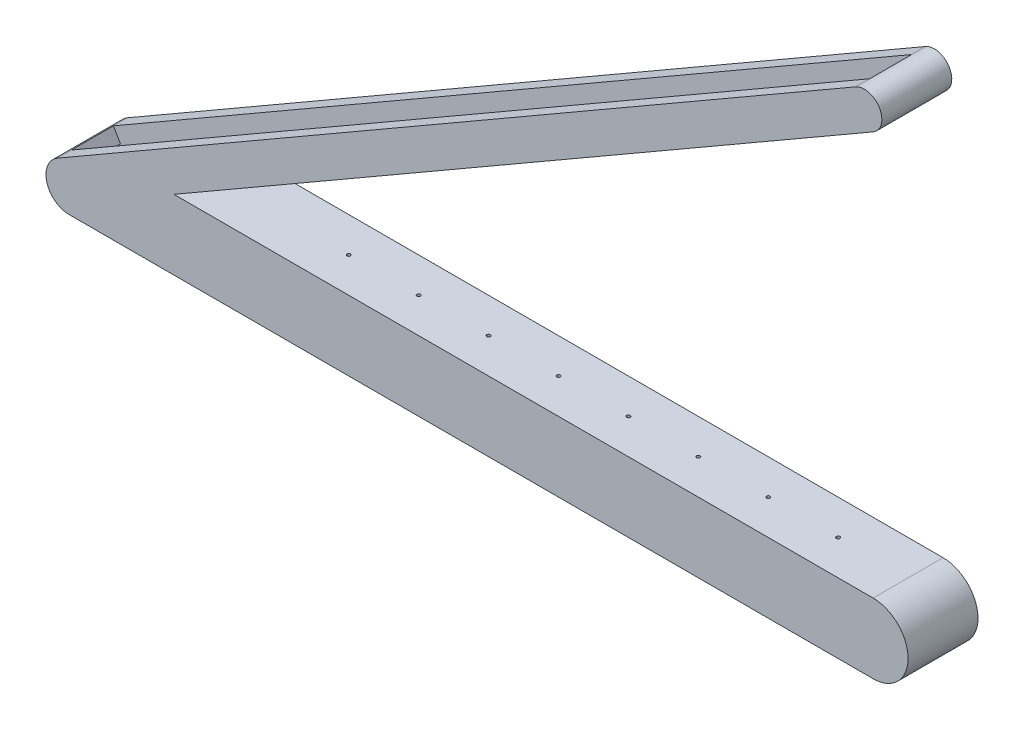
ISO-10303-21;
HEADER;
FILE_DESCRIPTION(('STEP AP214'),'2;1');
FILE_NAME('part.step','',(''),(''),'','','');
FILE_SCHEMA(('AUTOMOTIVE_DESIGN { 1 0 10303 214 1 1 1 1 }'));
ENDSEC;
DATA;
#1=APPLICATION_CONTEXT('core data for automotive mechanical design processes');
#2=APPLICATION_PROTOCOL_DEFINITION('international standard','automotive_design',2000,#1);
#3=PRODUCT_CONTEXT('',#1,'mechanical');
#4=PRODUCT('Part','Part','',(#3));
#5=PRODUCT_RELATED_PRODUCT_CATEGORY('part','',(#4));
#6=PRODUCT_DEFINITION_FORMATION('','',#4);
#7=PRODUCT_DEFINITION_CONTEXT('part definition',#1,'design');
#8=PRODUCT_DEFINITION('design','',#6,#7);
#9=PRODUCT_DEFINITION_SHAPE('','',#8);
#10=(LENGTH_UNIT() NAMED_UNIT(*) SI_UNIT(.MILLI.,.METRE.));
#11=(NAMED_UNIT(*) PLANE_ANGLE_UNIT() SI_UNIT($,.RADIAN.));
#12=(NAMED_UNIT(*) SI_UNIT($,.STERADIAN.) SOLID_ANGLE_UNIT());
#13=UNCERTAINTY_MEASURE_WITH_UNIT(LENGTH_MEASURE(1.E-05),#10,'distance_accuracy_value','');
#14=(GEOMETRIC_REPRESENTATION_CONTEXT(3) GLOBAL_UNCERTAINTY_ASSIGNED_CONTEXT((#13)) GLOBAL_UNIT_ASSIGNED_CONTEXT((#10,
#11,#12)) REPRESENTATION_CONTEXT('',''));
#15=CARTESIAN_POINT('',(0.,0.,0.));
#16=DIRECTION('',(0.,0.,1.));
#17=DIRECTION('',(1.,0.,0.));
#18=AXIS2_PLACEMENT_3D('',#15,#16,#17);
#19=CARTESIAN_POINT('',(-166.50635094611,-38.3974596215563,100.));
#20=DIRECTION('',(0.500000000000001,-0.866025403784438,0.));
#21=DIRECTION('',(0.866025403784438,0.500000000000001,0.));
#22=AXIS2_PLACEMENT_3D('',#19,#20,#21);
#23=PLANE('',#22);
#24=DIRECTION('',(-0.866025403784438,-0.500000000000001,0.));
#25=VECTOR('',#24,1.);
#26=CARTESIAN_POINT('',(-166.50635094611,-38.3974596215563,20.));
#27=LINE('',#26,#25);
#28=CARTESIAN_POINT('',(975.,620.651539378849,20.));
#29=VERTEX_POINT('',#28);
#30=CARTESIAN_POINT('',(-166.50635094611,-38.3974596215563,20.));
#31=VERTEX_POINT('',#30);
#32=EDGE_CURVE('E180',#29,#31,#27,.T.);
#33=ORIENTED_EDGE('',*,*,#32,.F.);
#34=DIRECTION('',(0.,0.,-1.));
#35=VECTOR('',#34,1.);
#36=CARTESIAN_POINT('',(975.,620.651539378849,100.));
#37=LINE('',#36,#35);
#38=CARTESIAN_POINT('',(975.,620.651539378849,0.));
#39=VERTEX_POINT('',#38);
#40=EDGE_CURVE('E364',#29,#39,#37,.T.);
#41=ORIENTED_EDGE('',*,*,#40,.T.);
#42=DIRECTION('',(-0.866025403784438,-0.500000000000001,0.));
#43=VECTOR('',#42,1.);
#44=CARTESIAN_POINT('',(-166.50635094611,-38.3974596215563,0.));
#45=LINE('',#44,#43);
#46=CARTESIAN_POINT('',(-166.50635094611,-38.3974596215563,0.));
#47=VERTEX_POINT('',#46);
#48=EDGE_CURVE('E325',#39,#47,#45,.T.);
#49=ORIENTED_EDGE('',*,*,#48,.T.);
#50=DIRECTION('',(0.,0.,-1.));
#51=VECTOR('',#50,1.);
#52=CARTESIAN_POINT('',(-166.50635094611,-38.3974596215563,100.));
#53=LINE('',#52,#51);
#54=EDGE_CURVE('E359',#31,#47,#53,.T.);
#55=ORIENTED_EDGE('',*,*,#54,.F.);
#56=EDGE_LOOP('',(#33,#41,#49,#55));
#57=FACE_BOUND('',#56,.T.);
#58=ADVANCED_FACE('F41',(#57),#23,.F.);
#59=CARTESIAN_POINT('',(1000.,-99.9999999999999,100.));
#60=DIRECTION('',(0.,1.,0.));
#61=DIRECTION('',(-1.,0.,0.));
#62=AXIS2_PLACEMENT_3D('',#59,#60,#61);
#63=PLANE('',#62);
#64=DIRECTION('',(1.,0.,0.));
#65=VECTOR('',#64,1.);
#66=CARTESIAN_POINT('',(1000.,-99.9999999999999,20.));
#67=LINE('',#66,#65);
#68=CARTESIAN_POINT('',(-150.,-100.,20.));
#69=VERTEX_POINT('',#68);
#70=CARTESIAN_POINT('',(1000.,-99.9999999999999,20.));
#71=VERTEX_POINT('',#70);
#72=EDGE_CURVE('E233',#69,#71,#67,.T.);
#73=ORIENTED_EDGE('',*,*,#72,.F.);
#74=DIRECTION('',(0.,0.,-1.));
#75=VECTOR('',#74,1.);
#76=CARTESIAN_POINT('',(-150.,-100.,100.));
#77=LINE('',#76,#75);
#78=CARTESIAN_POINT('',(-150.,-100.,0.));
#79=VERTEX_POINT('',#78);
#80=EDGE_CURVE('E354',#69,#79,#77,.T.);
#81=ORIENTED_EDGE('',*,*,#80,.T.);
#82=DIRECTION('',(1.,0.,0.));
#83=VECTOR('',#82,1.);
#84=CARTESIAN_POINT('',(1000.,-99.9999999999999,0.));
#85=LINE('',#84,#83);
#86=CARTESIAN_POINT('',(1000.,-99.9999999999999,0.));
#87=VERTEX_POINT('',#86);
#88=EDGE_CURVE('E333',#79,#87,#85,.T.);
#89=ORIENTED_EDGE('',*,*,#88,.T.);
#90=DIRECTION('',(0.,0.,-1.));
#91=VECTOR('',#90,1.);
#92=CARTESIAN_POINT('',(1000.,-99.9999999999999,100.));
#93=LINE('',#92,#91);
#94=EDGE_CURVE('E349',#71,#87,#93,.T.);
#95=ORIENTED_EDGE('',*,*,#94,.F.);
#96=EDGE_LOOP('',(#73,#81,#89,#95));
#97=FACE_BOUND('',#96,.T.);
#98=ADVANCED_FACE('F470',(#97),#63,.F.);
#99=CARTESIAN_POINT('',(0.,0.,100.));
#100=DIRECTION('',(-0.500000000000001,0.866025403784438,0.));
#101=DIRECTION('',(-0.866025403784438,-0.500000000000001,0.));
#102=AXIS2_PLACEMENT_3D('',#99,#100,#101);
#103=PLANE('',#102);
#104=CARTESIAN_POINT('',(200.,115.470053837926,50.));
#105=DIRECTION('',(-0.500000000000001,0.866025403784438,0.));
#106=DIRECTION('',(-0.866025403784438,-0.500000000000001,0.));
#107=AXIS2_PLACEMENT_3D('',#104,#105,#106);
#108=ELLIPSE('',#107,2.88675134594813,2.5);
#109=CARTESIAN_POINT('',(197.5,114.026678164952,50.));
#110=VERTEX_POINT('',#109);
#111=EDGE_CURVE('E199',#110,#110,#108,.F.);
#112=ORIENTED_EDGE('',*,*,#111,.F.);
#113=EDGE_LOOP('',(#112));
#114=FACE_BOUND('',#113,.T.);
#115=CARTESIAN_POINT('',(300.,173.205080756888,50.));
#116=DIRECTION('',(-0.500000000000001,0.866025403784438,0.));
#117=DIRECTION('',(-0.866025403784438,-0.500000000000001,0.));
#118=AXIS2_PLACEMENT_3D('',#115,#116,#117);
#119=ELLIPSE('',#118,2.8867513459481,2.49999999999997);
#120=CARTESIAN_POINT('',(297.5,171.761705083914,50.));
#121=VERTEX_POINT('',#120);
#122=EDGE_CURVE('E427',#121,#121,#119,.F.);
#123=ORIENTED_EDGE('',*,*,#122,.F.);
#124=EDGE_LOOP('',(#123));
#125=FACE_BOUND('',#124,.T.);
#126=CARTESIAN_POINT('',(400.,230.940107675851,50.));
#127=DIRECTION('',(-0.500000000000001,0.866025403784438,0.));
#128=DIRECTION('',(-0.866025403784438,-0.500000000000001,0.));
#129=AXIS2_PLACEMENT_3D('',#126,#127,#128);
#130=ELLIPSE('',#129,2.8867513459481,2.49999999999997);
#131=CARTESIAN_POINT('',(397.5,229.496732002877,50.));
#132=VERTEX_POINT('',#131);
#133=EDGE_CURVE('E406',#132,#132,#130,.F.);
#134=ORIENTED_EDGE('',*,*,#133,.F.);
#135=EDGE_LOOP('',(#134));
#136=FACE_BOUND('',#135,.T.);
#137=CARTESIAN_POINT('',(500.,288.675134594814,50.));
#138=DIRECTION('',(-0.500000000000001,0.866025403784438,0.));
#139=DIRECTION('',(-0.866025403784438,-0.500000000000001,0.));
#140=AXIS2_PLACEMENT_3D('',#137,#138,#139);
#141=ELLIPSE('',#140,2.88675134594816,2.50000000000002);
#142=CARTESIAN_POINT('',(497.5,287.23175892184,50.));
#143=VERTEX_POINT('',#142);
#144=EDGE_CURVE('E401',#143,#143,#141,.F.);
#145=ORIENTED_EDGE('',*,*,#144,.F.);
#146=EDGE_LOOP('',(#145));
#147=FACE_BOUND('',#146,.T.);
#148=CARTESIAN_POINT('',(600.,346.410161513777,50.));
#149=DIRECTION('',(-0.500000000000001,0.866025403784438,0.));
#150=DIRECTION('',(-0.866025403784438,-0.500000000000001,0.));
#151=AXIS2_PLACEMENT_3D('',#148,#149,#150);
#152=ELLIPSE('',#151,2.88675134594816,2.50000000000002);
#153=CARTESIAN_POINT('',(597.5,344.966785840803,50.));
#154=VERTEX_POINT('',#153);
#155=EDGE_CURVE('E396',#154,#154,#152,.F.);
#156=ORIENTED_EDGE('',*,*,#155,.F.);
#157=EDGE_LOOP('',(#156));
#158=FACE_BOUND('',#157,.T.);
#159=CARTESIAN_POINT('',(700.,404.14518843274,50.));
#160=DIRECTION('',(-0.500000000000001,0.866025403784438,0.));
#161=DIRECTION('',(-0.866025403784438,-0.500000000000001,0.));
#162=AXIS2_PLACEMENT_3D('',#159,#160,#161);
#163=ELLIPSE('',#162,2.88675134594816,2.50000000000002);
#164=CARTESIAN_POINT('',(697.5,402.701812759765,50.));
#165=VERTEX_POINT('',#164);
#166=EDGE_CURVE('E390',#165,#165,#163,.F.);
#167=ORIENTED_EDGE('',*,*,#166,.F.);
#168=EDGE_LOOP('',(#167));
#169=FACE_BOUND('',#168,.T.);
#170=CARTESIAN_POINT('',(800.,461.880215351702,50.));
#171=DIRECTION('',(-0.500000000000001,0.866025403784438,0.));
#172=DIRECTION('',(-0.866025403784438,-0.500000000000001,0.));
#173=AXIS2_PLACEMENT_3D('',#170,#171,#172);
#174=ELLIPSE('',#173,2.88675134594816,2.50000000000002);
#175=CARTESIAN_POINT('',(797.5,460.436839678728,50.));
#176=VERTEX_POINT('',#175);
#177=EDGE_CURVE('E384',#176,#176,#174,.F.);
#178=ORIENTED_EDGE('',*,*,#177,.F.);
#179=EDGE_LOOP('',(#178));
#180=FACE_BOUND('',#179,.T.);
#181=CARTESIAN_POINT('',(900.,519.615242270665,50.));
#182=DIRECTION('',(-0.500000000000001,0.866025403784438,0.));
#183=DIRECTION('',(-0.866025403784438,-0.500000000000001,0.));
#184=AXIS2_PLACEMENT_3D('',#181,#182,#183);
#185=ELLIPSE('',#184,2.88675134594816,2.50000000000002);
#186=CARTESIAN_POINT('',(897.5,518.171866597691,50.));
#187=VERTEX_POINT('',#186);
#188=EDGE_CURVE('E378',#187,#187,#185,.F.);
#189=ORIENTED_EDGE('',*,*,#188,.F.);
#190=EDGE_LOOP('',(#189));
#191=FACE_BOUND('',#190,.T.);
#192=DIRECTION('',(0.866025403784438,0.500000000000001,0.));
#193=VECTOR('',#192,1.);
#194=CARTESIAN_POINT('',(0.,0.,0.));
#195=LINE('',#194,#193);
#196=CARTESIAN_POINT('',(0.,0.,0.));
#197=VERTEX_POINT('',#196);
#198=CARTESIAN_POINT('',(1000.,577.350269189628,0.));
#199=VERTEX_POINT('',#198);
#200=EDGE_CURVE('E290',#197,#199,#195,.T.);
#201=ORIENTED_EDGE('',*,*,#200,.T.);
#202=DIRECTION('',(0.,0.,-1.));
#203=VECTOR('',#202,1.);
#204=CARTESIAN_POINT('',(1000.,577.350269189628,100.));
#205=LINE('',#204,#203);
#206=CARTESIAN_POINT('',(1000.,577.350269189628,100.));
#207=VERTEX_POINT('',#206);
#208=EDGE_CURVE('E11',#207,#199,#205,.T.);
#209=ORIENTED_EDGE('',*,*,#208,.F.);
#210=DIRECTION('',(0.866025403784438,0.500000000000001,0.));
#211=VECTOR('',#210,1.);
#212=CARTESIAN_POINT('',(0.,0.,100.));
#213=LINE('',#212,#211);
#214=CARTESIAN_POINT('',(0.,0.,100.));
#215=VERTEX_POINT('',#214);
#216=EDGE_CURVE('E294',#215,#207,#213,.T.);
#217=ORIENTED_EDGE('',*,*,#216,.F.);
#218=DIRECTION('',(0.,0.,-1.));
#219=VECTOR('',#218,1.);
#220=CARTESIAN_POINT('',(0.,0.,100.));
#221=LINE('',#220,#219);
#222=EDGE_CURVE('E317',#215,#197,#221,.T.);
#223=ORIENTED_EDGE('',*,*,#222,.T.);
#224=EDGE_LOOP('',(#201,#209,#217,#223));
#225=FACE_BOUND('',#224,.T.);
#226=ADVANCED_FACE('F43',(#114,#125,#136,#147,#158,#169,#180,#191,#225),#103,.F.);
#227=CARTESIAN_POINT('',(987.5,599.000904284239,100.));
#228=DIRECTION('',(0.,0.,-1.));
#229=DIRECTION('',(-1.,0.,0.));
#230=AXIS2_PLACEMENT_3D('',#227,#228,#229);
#231=CYLINDRICAL_SURFACE('',#230,24.9999999999999);
#232=CARTESIAN_POINT('',(987.5,599.000904284239,0.));
#233=DIRECTION('',(0.,0.,1.));
#234=DIRECTION('',(1.,0.,0.));
#235=AXIS2_PLACEMENT_3D('',#232,#233,#234);
#236=CIRCLE('',#235,24.9999999999999);
#237=EDGE_CURVE('E321',#199,#39,#236,.T.);
#238=ORIENTED_EDGE('',*,*,#237,.T.);
#239=ORIENTED_EDGE('',*,*,#40,.F.);
#240=DIRECTION('',(0.,0.,-1.));
#241=VECTOR('',#240,1.);
#242=CARTESIAN_POINT('',(975.,620.651539378849,100.));
#243=LINE('',#242,#241);
#244=CARTESIAN_POINT('',(975.,620.651539378849,80.));
#245=VERTEX_POINT('',#244);
#246=EDGE_CURVE('E192',#245,#29,#243,.T.);
#247=ORIENTED_EDGE('',*,*,#246,.F.);
#248=CARTESIAN_POINT('',(975.,620.651539378849,100.));
#249=VERTEX_POINT('',#248);
#250=EDGE_CURVE('E51',#249,#245,#37,.T.);
#251=ORIENTED_EDGE('',*,*,#250,.F.);
#252=CARTESIAN_POINT('',(987.5,599.000904284239,100.));
#253=DIRECTION('',(0.,0.,1.));
#254=DIRECTION('',(1.,0.,0.));
#255=AXIS2_PLACEMENT_3D('',#252,#253,#254);
#256=CIRCLE('',#255,24.9999999999999);
#257=EDGE_CURVE('E298',#207,#249,#256,.T.);
#258=ORIENTED_EDGE('',*,*,#257,.F.);
#259=ORIENTED_EDGE('',*,*,#208,.T.);
#260=EDGE_LOOP('',(#238,#239,#247,#251,#258,#259));
#261=FACE_BOUND('',#260,.T.);
#262=ADVANCED_FACE('F456',(#261),#231,.T.);
#263=ORIENTED_EDGE('',*,*,#250,.T.);
#264=DIRECTION('',(-0.866025403784438,-0.500000000000001,0.));
#265=VECTOR('',#264,1.);
#266=CARTESIAN_POINT('',(-166.50635094611,-38.3974596215563,80.));
#267=LINE('',#266,#265);
#268=CARTESIAN_POINT('',(-166.50635094611,-38.3974596215563,80.));
#269=VERTEX_POINT('',#268);
#270=EDGE_CURVE('E218',#245,#269,#267,.T.);
#271=ORIENTED_EDGE('',*,*,#270,.T.);
#272=CARTESIAN_POINT('',(-166.50635094611,-38.3974596215563,100.));
#273=VERTEX_POINT('',#272);
#274=EDGE_CURVE('E360',#273,#269,#53,.T.);
#275=ORIENTED_EDGE('',*,*,#274,.F.);
#276=DIRECTION('',(-0.866025403784438,-0.500000000000001,0.));
#277=VECTOR('',#276,1.);
#278=CARTESIAN_POINT('',(-166.50635094611,-38.3974596215563,100.));
#279=LINE('',#278,#277);
#280=EDGE_CURVE('E302',#249,#273,#279,.T.);
#281=ORIENTED_EDGE('',*,*,#280,.F.);
#282=EDGE_LOOP('',(#263,#271,#275,#281));
#283=FACE_BOUND('',#282,.T.);
#284=ADVANCED_FACE('F507',(#283),#23,.F.);
#285=CARTESIAN_POINT('',(-150.,-66.9872981077808,100.));
#286=DIRECTION('',(0.,0.,-1.));
#287=DIRECTION('',(-1.,0.,0.));
#288=AXIS2_PLACEMENT_3D('',#285,#286,#287);
#289=CYLINDRICAL_SURFACE('',#288,33.0127018922193);
#290=CARTESIAN_POINT('',(-150.,-66.9872981077808,0.));
#291=DIRECTION('',(0.,0.,1.));
#292=DIRECTION('',(1.,0.,0.));
#293=AXIS2_PLACEMENT_3D('',#290,#291,#292);
#294=CIRCLE('',#293,33.0127018922193);
#295=EDGE_CURVE('E329',#47,#79,#294,.T.);
#296=ORIENTED_EDGE('',*,*,#295,.T.);
#297=ORIENTED_EDGE('',*,*,#80,.F.);
#298=DIRECTION('',(0.,0.,-1.));
#299=VECTOR('',#298,1.);
#300=CARTESIAN_POINT('',(-150.,-100.,100.));
#301=LINE('',#300,#299);
#302=CARTESIAN_POINT('',(-150.,-100.,80.));
#303=VERTEX_POINT('',#302);
#304=EDGE_CURVE('E441',#303,#69,#301,.T.);
#305=ORIENTED_EDGE('',*,*,#304,.F.);
#306=CARTESIAN_POINT('',(-150.,-100.,100.));
#307=VERTEX_POINT('',#306);
#308=EDGE_CURVE('E355',#307,#303,#77,.T.);
#309=ORIENTED_EDGE('',*,*,#308,.F.);
#310=CARTESIAN_POINT('',(-150.,-66.9872981077808,100.));
#311=DIRECTION('',(0.,0.,1.));
#312=DIRECTION('',(1.,0.,0.));
#313=AXIS2_PLACEMENT_3D('',#310,#311,#312);
#314=CIRCLE('',#313,33.0127018922193);
#315=EDGE_CURVE('E305',#273,#307,#314,.T.);
#316=ORIENTED_EDGE('',*,*,#315,.F.);
#317=ORIENTED_EDGE('',*,*,#274,.T.);
#318=DIRECTION('',(0.,0.,-1.));
#319=VECTOR('',#318,1.);
#320=CARTESIAN_POINT('',(-166.50635094611,-38.3974596215563,100.));
#321=LINE('',#320,#319);
#322=EDGE_CURVE('E443',#269,#31,#321,.T.);
#323=ORIENTED_EDGE('',*,*,#322,.T.);
#324=ORIENTED_EDGE('',*,*,#54,.T.);
#325=EDGE_LOOP('',(#296,#297,#305,#309,#316,#317,#323,#324));
#326=FACE_BOUND('',#325,.T.);
#327=ADVANCED_FACE('F497',(#326),#289,.T.);
#328=ORIENTED_EDGE('',*,*,#308,.T.);
#329=DIRECTION('',(1.,0.,0.));
#330=VECTOR('',#329,1.);
#331=CARTESIAN_POINT('',(1000.,-99.9999999999999,80.));
#332=LINE('',#331,#330);
#333=CARTESIAN_POINT('',(1000.,-99.9999999999999,80.));
#334=VERTEX_POINT('',#333);
#335=EDGE_CURVE('E223',#303,#334,#332,.T.);
#336=ORIENTED_EDGE('',*,*,#335,.T.);
#337=CARTESIAN_POINT('',(1000.,-99.9999999999999,100.));
#338=VERTEX_POINT('',#337);
#339=EDGE_CURVE('E350',#338,#334,#93,.T.);
#340=ORIENTED_EDGE('',*,*,#339,.F.);
#341=DIRECTION('',(1.,0.,0.));
#342=VECTOR('',#341,1.);
#343=CARTESIAN_POINT('',(1000.,-99.9999999999999,100.));
#344=LINE('',#343,#342);
#345=EDGE_CURVE('E308',#307,#338,#344,.T.);
#346=ORIENTED_EDGE('',*,*,#345,.F.);
#347=EDGE_LOOP('',(#328,#336,#340,#346));
#348=FACE_BOUND('',#347,.T.);
#349=ADVANCED_FACE('F490',(#348),#63,.F.);
#350=CARTESIAN_POINT('',(1000.,-50.,100.));
#351=DIRECTION('',(0.,0.,-1.));
#352=DIRECTION('',(-1.,0.,0.));
#353=AXIS2_PLACEMENT_3D('',#350,#351,#352);
#354=CYLINDRICAL_SURFACE('',#353,50.);
#355=CARTESIAN_POINT('',(1000.,-50.,0.));
#356=DIRECTION('',(0.,0.,1.));
#357=DIRECTION('',(-1.,0.,0.));
#358=AXIS2_PLACEMENT_3D('',#355,#356,#357);
#359=CIRCLE('',#358,50.);
#360=CARTESIAN_POINT('',(1000.,0.,0.));
#361=VERTEX_POINT('',#360);
#362=EDGE_CURVE('E337',#87,#361,#359,.T.);
#363=ORIENTED_EDGE('',*,*,#362,.T.);
#364=DIRECTION('',(0.,0.,-1.));
#365=VECTOR('',#364,1.);
#366=CARTESIAN_POINT('',(1000.,0.,100.));
#367=LINE('',#366,#365);
#368=CARTESIAN_POINT('',(1000.,0.,100.));
#369=VERTEX_POINT('',#368);
#370=EDGE_CURVE('E345',#369,#361,#367,.T.);
#371=ORIENTED_EDGE('',*,*,#370,.F.);
#372=CARTESIAN_POINT('',(1000.,-50.,100.));
#373=DIRECTION('',(0.,0.,1.));
#374=DIRECTION('',(-1.,0.,0.));
#375=AXIS2_PLACEMENT_3D('',#372,#373,#374);
#376=CIRCLE('',#375,50.);
#377=EDGE_CURVE('E311',#338,#369,#376,.T.);
#378=ORIENTED_EDGE('',*,*,#377,.F.);
#379=ORIENTED_EDGE('',*,*,#339,.T.);
#380=DIRECTION('',(0.,0.,-1.));
#381=VECTOR('',#380,1.);
#382=CARTESIAN_POINT('',(1000.,-99.9999999999999,100.));
#383=LINE('',#382,#381);
#384=EDGE_CURVE('E242',#334,#71,#383,.T.);
#385=ORIENTED_EDGE('',*,*,#384,.T.);
#386=ORIENTED_EDGE('',*,*,#94,.T.);
#387=EDGE_LOOP('',(#363,#371,#378,#379,#385,#386));
#388=FACE_BOUND('',#387,.T.);
#389=ADVANCED_FACE('F464',(#388),#354,.T.);
#390=CARTESIAN_POINT('',(0.,0.,100.));
#391=DIRECTION('',(0.,-1.,0.));
#392=DIRECTION('',(0.,0.,-1.));
#393=AXIS2_PLACEMENT_3D('',#390,#391,#392);
#394=PLANE('',#393);
#395=CARTESIAN_POINT('',(200.,0.,50.));
#396=DIRECTION('',(0.,-1.,0.));
#397=DIRECTION('',(0.,0.,-1.));
#398=AXIS2_PLACEMENT_3D('',#395,#396,#397);
#399=CIRCLE('',#398,2.5);
#400=CARTESIAN_POINT('',(200.,0.,47.5));
#401=VERTEX_POINT('',#400);
#402=EDGE_CURVE('E203',#401,#401,#399,.F.);
#403=ORIENTED_EDGE('',*,*,#402,.F.);
#404=EDGE_LOOP('',(#403));
#405=FACE_BOUND('',#404,.T.);
#406=CARTESIAN_POINT('',(300.,0.,50.));
#407=DIRECTION('',(0.,-1.,0.));
#408=DIRECTION('',(0.,0.,-1.));
#409=AXIS2_PLACEMENT_3D('',#406,#407,#408);
#410=CIRCLE('',#409,2.49999999999997);
#411=CARTESIAN_POINT('',(300.,0.,47.5000000000001));
#412=VERTEX_POINT('',#411);
#413=EDGE_CURVE('E412',#412,#412,#410,.F.);
#414=ORIENTED_EDGE('',*,*,#413,.F.);
#415=EDGE_LOOP('',(#414));
#416=FACE_BOUND('',#415,.T.);
#417=CARTESIAN_POINT('',(400.,0.,50.));
#418=DIRECTION('',(0.,-1.,0.));
#419=DIRECTION('',(0.,0.,-1.));
#420=AXIS2_PLACEMENT_3D('',#417,#418,#419);
#421=CIRCLE('',#420,2.49999999999997);
#422=CARTESIAN_POINT('',(400.,0.,47.5000000000001));
#423=VERTEX_POINT('',#422);
#424=EDGE_CURVE('E415',#423,#423,#421,.F.);
#425=ORIENTED_EDGE('',*,*,#424,.F.);
#426=EDGE_LOOP('',(#425));
#427=FACE_BOUND('',#426,.T.);
#428=CARTESIAN_POINT('',(500.,0.,50.));
#429=DIRECTION('',(0.,-1.,0.));
#430=DIRECTION('',(0.,0.,-1.));
#431=AXIS2_PLACEMENT_3D('',#428,#429,#430);
#432=CIRCLE('',#431,2.50000000000002);
#433=CARTESIAN_POINT('',(500.,0.,47.5));
#434=VERTEX_POINT('',#433);
#435=EDGE_CURVE('E631',#434,#434,#432,.F.);
#436=ORIENTED_EDGE('',*,*,#435,.F.);
#437=EDGE_LOOP('',(#436));
#438=FACE_BOUND('',#437,.T.);
#439=CARTESIAN_POINT('',(600.,0.,50.));
#440=DIRECTION('',(0.,-1.,0.));
#441=DIRECTION('',(0.,0.,-1.));
#442=AXIS2_PLACEMENT_3D('',#439,#440,#441);
#443=CIRCLE('',#442,2.50000000000002);
#444=CARTESIAN_POINT('',(600.,0.,47.5));
#445=VERTEX_POINT('',#444);
#446=EDGE_CURVE('E635',#445,#445,#443,.F.);
#447=ORIENTED_EDGE('',*,*,#446,.F.);
#448=EDGE_LOOP('',(#447));
#449=FACE_BOUND('',#448,.T.);
#450=CARTESIAN_POINT('',(700.,0.,50.));
#451=DIRECTION('',(0.,-1.,0.));
#452=DIRECTION('',(0.,0.,-1.));
#453=AXIS2_PLACEMENT_3D('',#450,#451,#452);
#454=CIRCLE('',#453,2.50000000000002);
#455=CARTESIAN_POINT('',(700.,0.,47.5));
#456=VERTEX_POINT('',#455);
#457=EDGE_CURVE('E639',#456,#456,#454,.F.);
#458=ORIENTED_EDGE('',*,*,#457,.F.);
#459=EDGE_LOOP('',(#458));
#460=FACE_BOUND('',#459,.T.);
#461=CARTESIAN_POINT('',(800.,0.,50.));
#462=DIRECTION('',(0.,-1.,0.));
#463=DIRECTION('',(0.,0.,-1.));
#464=AXIS2_PLACEMENT_3D('',#461,#462,#463);
#465=CIRCLE('',#464,2.50000000000002);
#466=CARTESIAN_POINT('',(800.,0.,47.5));
#467=VERTEX_POINT('',#466);
#468=EDGE_CURVE('E643',#467,#467,#465,.F.);
#469=ORIENTED_EDGE('',*,*,#468,.F.);
#470=EDGE_LOOP('',(#469));
#471=FACE_BOUND('',#470,.T.);
#472=CARTESIAN_POINT('',(900.,0.,50.));
#473=DIRECTION('',(0.,-1.,0.));
#474=DIRECTION('',(0.,0.,-1.));
#475=AXIS2_PLACEMENT_3D('',#472,#473,#474);
#476=CIRCLE('',#475,2.50000000000002);
#477=CARTESIAN_POINT('',(900.,0.,47.5));
#478=VERTEX_POINT('',#477);
#479=EDGE_CURVE('E646',#478,#478,#476,.F.);
#480=ORIENTED_EDGE('',*,*,#479,.F.);
#481=EDGE_LOOP('',(#480));
#482=FACE_BOUND('',#481,.T.);
#483=DIRECTION('',(-1.,0.,0.));
#484=VECTOR('',#483,1.);
#485=CARTESIAN_POINT('',(0.,0.,0.));
#486=LINE('',#485,#484);
#487=EDGE_CURVE('E299',#361,#197,#486,.T.);
#488=ORIENTED_EDGE('',*,*,#487,.T.);
#489=ORIENTED_EDGE('',*,*,#222,.F.);
#490=DIRECTION('',(-1.,0.,0.));
#491=VECTOR('',#490,1.);
#492=CARTESIAN_POINT('',(0.,0.,100.));
#493=LINE('',#492,#491);
#494=EDGE_CURVE('E314',#369,#215,#493,.T.);
#495=ORIENTED_EDGE('',*,*,#494,.F.);
#496=ORIENTED_EDGE('',*,*,#370,.T.);
#497=EDGE_LOOP('',(#488,#489,#495,#496));
#498=FACE_BOUND('',#497,.T.);
#499=ADVANCED_FACE('F479',(#405,#416,#427,#438,#449,#460,#471,#482,#498),#394,.F.);
#500=CARTESIAN_POINT('',(987.5,599.000904284239,100.));
#501=DIRECTION('',(0.,0.,1.));
#502=DIRECTION('',(1.,0.,0.));
#503=AXIS2_PLACEMENT_3D('',#500,#501,#502);
#504=PLANE('',#503);
#505=ORIENTED_EDGE('',*,*,#216,.T.);
#506=ORIENTED_EDGE('',*,*,#257,.T.);
#507=ORIENTED_EDGE('',*,*,#280,.T.);
#508=ORIENTED_EDGE('',*,*,#315,.T.);
#509=ORIENTED_EDGE('',*,*,#345,.T.);
#510=ORIENTED_EDGE('',*,*,#377,.T.);
#511=ORIENTED_EDGE('',*,*,#494,.T.);
#512=EDGE_LOOP('',(#505,#506,#507,#508,#509,#510,#511));
#513=FACE_BOUND('',#512,.T.);
#514=ADVANCED_FACE('F485',(#513),#504,.T.);
#515=CARTESIAN_POINT('',(987.5,599.000904284239,0.));
#516=DIRECTION('',(0.,0.,1.));
#517=DIRECTION('',(1.,0.,0.));
#518=AXIS2_PLACEMENT_3D('',#515,#516,#517);
#519=PLANE('',#518);
#520=ORIENTED_EDGE('',*,*,#200,.F.);
#521=ORIENTED_EDGE('',*,*,#487,.F.);
#522=ORIENTED_EDGE('',*,*,#362,.F.);
#523=ORIENTED_EDGE('',*,*,#88,.F.);
#524=ORIENTED_EDGE('',*,*,#295,.F.);
#525=ORIENTED_EDGE('',*,*,#48,.F.);
#526=ORIENTED_EDGE('',*,*,#237,.F.);
#527=EDGE_LOOP('',(#520,#521,#522,#523,#524,#525,#526));
#528=FACE_BOUND('',#527,.T.);
#529=ADVANCED_FACE('F476',(#528),#519,.F.);
#530=CARTESIAN_POINT('',(-150.,-100.,100.));
#531=DIRECTION('',(1.,0.,0.));
#532=DIRECTION('',(0.,0.,-1.));
#533=AXIS2_PLACEMENT_3D('',#530,#531,#532);
#534=PLANE('',#533);
#535=ORIENTED_EDGE('',*,*,#304,.T.);
#536=DIRECTION('',(0.,-1.,0.));
#537=VECTOR('',#536,1.);
#538=CARTESIAN_POINT('',(-150.,-100.,20.));
#539=LINE('',#538,#537);
#540=CARTESIAN_POINT('',(-150.,-80.0000000000001,20.));
#541=VERTEX_POINT('',#540);
#542=EDGE_CURVE('E276',#541,#69,#539,.T.);
#543=ORIENTED_EDGE('',*,*,#542,.F.);
#544=DIRECTION('',(0.,0.,-1.));
#545=VECTOR('',#544,1.);
#546=CARTESIAN_POINT('',(-150.,-80.0000000000001,50.));
#547=LINE('',#546,#545);
#548=CARTESIAN_POINT('',(-150.,-80.0000000000001,80.));
#549=VERTEX_POINT('',#548);
#550=EDGE_CURVE('E260',#549,#541,#547,.T.);
#551=ORIENTED_EDGE('',*,*,#550,.F.);
#552=DIRECTION('',(0.,-1.,0.));
#553=VECTOR('',#552,1.);
#554=CARTESIAN_POINT('',(-150.,-100.,80.));
#555=LINE('',#554,#553);
#556=EDGE_CURVE('E67',#549,#303,#555,.T.);
#557=ORIENTED_EDGE('',*,*,#556,.T.);
#558=EDGE_LOOP('',(#535,#543,#551,#557));
#559=FACE_BOUND('',#558,.T.);
#560=ADVANCED_FACE('F499',(#559),#534,.T.);
#561=CARTESIAN_POINT('',(1000.,-99.9999999999999,100.));
#562=DIRECTION('',(1.,0.,0.));
#563=DIRECTION('',(0.,0.,-1.));
#564=AXIS2_PLACEMENT_3D('',#561,#562,#563);
#565=PLANE('',#564);
#566=ORIENTED_EDGE('',*,*,#384,.F.);
#567=DIRECTION('',(0.,-1.,0.));
#568=VECTOR('',#567,1.);
#569=CARTESIAN_POINT('',(1000.,-99.9999999999999,80.));
#570=LINE('',#569,#568);
#571=CARTESIAN_POINT('',(1000.,-79.9999999999999,80.));
#572=VERTEX_POINT('',#571);
#573=EDGE_CURVE('E266',#572,#334,#570,.T.);
#574=ORIENTED_EDGE('',*,*,#573,.F.);
#575=DIRECTION('',(0.,0.,-1.));
#576=VECTOR('',#575,1.);
#577=CARTESIAN_POINT('',(1000.,-79.9999999999999,50.));
#578=LINE('',#577,#576);
#579=CARTESIAN_POINT('',(1000.,-79.9999999999999,20.));
#580=VERTEX_POINT('',#579);
#581=EDGE_CURVE('E245',#572,#580,#578,.T.);
#582=ORIENTED_EDGE('',*,*,#581,.T.);
#583=DIRECTION('',(0.,-1.,0.));
#584=VECTOR('',#583,1.);
#585=CARTESIAN_POINT('',(1000.,-99.9999999999999,20.));
#586=LINE('',#585,#584);
#587=EDGE_CURVE('E272',#580,#71,#586,.T.);
#588=ORIENTED_EDGE('',*,*,#587,.T.);
#589=EDGE_LOOP('',(#566,#574,#582,#588));
#590=FACE_BOUND('',#589,.T.);
#591=ADVANCED_FACE('F563',(#590),#565,.F.);
#592=CARTESIAN_POINT('',(975.,620.651539378849,100.));
#593=DIRECTION('',(-0.866025403784438,-0.500000000000001,0.));
#594=DIRECTION('',(0.,0.,-1.));
#595=AXIS2_PLACEMENT_3D('',#592,#593,#594);
#596=PLANE('',#595);
#597=ORIENTED_EDGE('',*,*,#246,.T.);
#598=DIRECTION('',(-0.500000000000001,0.866025403784438,0.));
#599=VECTOR('',#598,1.);
#600=CARTESIAN_POINT('',(975.,620.651539378849,20.));
#601=LINE('',#600,#599);
#602=CARTESIAN_POINT('',(985.,603.331031303161,20.));
#603=VERTEX_POINT('',#602);
#604=EDGE_CURVE('E252',#603,#29,#601,.T.);
#605=ORIENTED_EDGE('',*,*,#604,.F.);
#606=DIRECTION('',(0.,0.,-1.));
#607=VECTOR('',#606,1.);
#608=CARTESIAN_POINT('',(985.,603.331031303161,50.));
#609=LINE('',#608,#607);
#610=CARTESIAN_POINT('',(985.,603.331031303161,80.));
#611=VERTEX_POINT('',#610);
#612=EDGE_CURVE('E175',#611,#603,#609,.T.);
#613=ORIENTED_EDGE('',*,*,#612,.F.);
#614=DIRECTION('',(0.500000000000001,-0.866025403784438,0.));
#615=VECTOR('',#614,1.);
#616=CARTESIAN_POINT('',(987.5,599.000904284239,80.));
#617=LINE('',#616,#615);
#618=EDGE_CURVE('E59',#611,#245,#617,.F.);
#619=ORIENTED_EDGE('',*,*,#618,.T.);
#620=EDGE_LOOP('',(#597,#605,#613,#619));
#621=FACE_BOUND('',#620,.T.);
#622=ADVANCED_FACE('F449',(#621),#596,.T.);
#623=CARTESIAN_POINT('',(-166.50635094611,-38.3974596215563,100.));
#624=DIRECTION('',(-0.866025403784438,-0.500000000000001,0.));
#625=DIRECTION('',(0.,0.,-1.));
#626=AXIS2_PLACEMENT_3D('',#623,#624,#625);
#627=PLANE('',#626);
#628=ORIENTED_EDGE('',*,*,#322,.F.);
#629=DIRECTION('',(-0.500000000000001,0.866025403784438,0.));
#630=VECTOR('',#629,1.);
#631=CARTESIAN_POINT('',(-166.50635094611,-38.3974596215563,80.));
#632=LINE('',#631,#630);
#633=CARTESIAN_POINT('',(-156.50635094611,-55.7179676972451,80.));
#634=VERTEX_POINT('',#633);
#635=EDGE_CURVE('E253',#634,#269,#632,.T.);
#636=ORIENTED_EDGE('',*,*,#635,.F.);
#637=DIRECTION('',(0.,0.,-1.));
#638=VECTOR('',#637,1.);
#639=CARTESIAN_POINT('',(-156.50635094611,-55.7179676972451,50.));
#640=LINE('',#639,#638);
#641=CARTESIAN_POINT('',(-156.50635094611,-55.7179676972451,20.));
#642=VERTEX_POINT('',#641);
#643=EDGE_CURVE('E191',#634,#642,#640,.T.);
#644=ORIENTED_EDGE('',*,*,#643,.T.);
#645=DIRECTION('',(-0.500000000000001,0.866025403784438,0.));
#646=VECTOR('',#645,1.);
#647=CARTESIAN_POINT('',(-166.50635094611,-38.3974596215563,20.));
#648=LINE('',#647,#646);
#649=EDGE_CURVE('E248',#642,#31,#648,.T.);
#650=ORIENTED_EDGE('',*,*,#649,.T.);
#651=EDGE_LOOP('',(#628,#636,#644,#650));
#652=FACE_BOUND('',#651,.T.);
#653=ADVANCED_FACE('F559',(#652),#627,.F.);
#654=CARTESIAN_POINT('',(-10.,17.3205080756888,100.));
#655=DIRECTION('',(-0.500000000000001,0.866025403784438,0.));
#656=DIRECTION('',(-0.866025403784438,-0.500000000000001,0.));
#657=AXIS2_PLACEMENT_3D('',#654,#655,#656);
#658=PLANE('',#657);
#659=CARTESIAN_POINT('',(200.,138.564064605511,50.));
#660=DIRECTION('',(-0.500000000000001,0.866025403784438,0.));
#661=DIRECTION('',(-0.866025403784438,-0.500000000000001,0.));
#662=AXIS2_PLACEMENT_3D('',#659,#660,#661);
#663=ELLIPSE('',#662,2.88675134594813,2.5);
#664=CARTESIAN_POINT('',(197.5,137.120688932537,50.));
#665=VERTEX_POINT('',#664);
#666=EDGE_CURVE('E431',#665,#665,#663,.F.);
#667=ORIENTED_EDGE('',*,*,#666,.T.);
#668=EDGE_LOOP('',(#667));
#669=FACE_BOUND('',#668,.T.);
#670=CARTESIAN_POINT('',(300.,196.299091524473,50.));
#671=DIRECTION('',(-0.500000000000001,0.866025403784438,0.));
#672=DIRECTION('',(-0.866025403784438,-0.500000000000001,0.));
#673=AXIS2_PLACEMENT_3D('',#670,#671,#672);
#674=ELLIPSE('',#673,2.8867513459481,2.49999999999997);
#675=CARTESIAN_POINT('',(297.5,194.855715851499,50.));
#676=VERTEX_POINT('',#675);
#677=EDGE_CURVE('E405',#676,#676,#674,.F.);
#678=ORIENTED_EDGE('',*,*,#677,.T.);
#679=EDGE_LOOP('',(#678));
#680=FACE_BOUND('',#679,.T.);
#681=CARTESIAN_POINT('',(400.,254.034118443436,50.));
#682=DIRECTION('',(-0.500000000000001,0.866025403784438,0.));
#683=DIRECTION('',(-0.866025403784438,-0.500000000000001,0.));
#684=AXIS2_PLACEMENT_3D('',#681,#682,#683);
#685=ELLIPSE('',#684,2.8867513459481,2.49999999999997);
#686=CARTESIAN_POINT('',(397.5,252.590742770462,50.));
#687=VERTEX_POINT('',#686);
#688=EDGE_CURVE('E400',#687,#687,#685,.F.);
#689=ORIENTED_EDGE('',*,*,#688,.T.);
#690=EDGE_LOOP('',(#689));
#691=FACE_BOUND('',#690,.T.);
#692=CARTESIAN_POINT('',(500.,311.769145362399,50.));
#693=DIRECTION('',(-0.500000000000001,0.866025403784438,0.));
#694=DIRECTION('',(-0.866025403784438,-0.500000000000001,0.));
#695=AXIS2_PLACEMENT_3D('',#692,#693,#694);
#696=ELLIPSE('',#695,2.88675134594816,2.50000000000002);
#697=CARTESIAN_POINT('',(497.5,310.325769689425,50.));
#698=VERTEX_POINT('',#697);
#699=EDGE_CURVE('E395',#698,#698,#696,.F.);
#700=ORIENTED_EDGE('',*,*,#699,.T.);
#701=EDGE_LOOP('',(#700));
#702=FACE_BOUND('',#701,.T.);
#703=CARTESIAN_POINT('',(600.,369.504172281362,50.));
#704=DIRECTION('',(-0.500000000000001,0.866025403784438,0.));
#705=DIRECTION('',(-0.866025403784438,-0.500000000000001,0.));
#706=AXIS2_PLACEMENT_3D('',#703,#704,#705);
#707=ELLIPSE('',#706,2.88675134594816,2.50000000000002);
#708=CARTESIAN_POINT('',(597.5,368.060796608388,50.));
#709=VERTEX_POINT('',#708);
#710=EDGE_CURVE('E389',#709,#709,#707,.F.);
#711=ORIENTED_EDGE('',*,*,#710,.T.);
#712=EDGE_LOOP('',(#711));
#713=FACE_BOUND('',#712,.T.);
#714=CARTESIAN_POINT('',(700.,427.239199200324,50.));
#715=DIRECTION('',(-0.500000000000001,0.866025403784438,0.));
#716=DIRECTION('',(-0.866025403784438,-0.500000000000001,0.));
#717=AXIS2_PLACEMENT_3D('',#714,#715,#716);
#718=ELLIPSE('',#717,2.88675134594816,2.50000000000002);
#719=CARTESIAN_POINT('',(697.5,425.79582352735,50.));
#720=VERTEX_POINT('',#719);
#721=EDGE_CURVE('E383',#720,#720,#718,.F.);
#722=ORIENTED_EDGE('',*,*,#721,.T.);
#723=EDGE_LOOP('',(#722));
#724=FACE_BOUND('',#723,.T.);
#725=CARTESIAN_POINT('',(800.,484.974226119287,50.));
#726=DIRECTION('',(-0.500000000000001,0.866025403784438,0.));
#727=DIRECTION('',(-0.866025403784438,-0.500000000000001,0.));
#728=AXIS2_PLACEMENT_3D('',#725,#726,#727);
#729=ELLIPSE('',#728,2.88675134594816,2.50000000000002);
#730=CARTESIAN_POINT('',(797.5,483.530850446313,50.));
#731=VERTEX_POINT('',#730);
#732=EDGE_CURVE('E377',#731,#731,#729,.F.);
#733=ORIENTED_EDGE('',*,*,#732,.T.);
#734=EDGE_LOOP('',(#733));
#735=FACE_BOUND('',#734,.T.);
#736=CARTESIAN_POINT('',(900.,542.70925303825,50.));
#737=DIRECTION('',(-0.500000000000001,0.866025403784438,0.));
#738=DIRECTION('',(-0.866025403784438,-0.500000000000001,0.));
#739=AXIS2_PLACEMENT_3D('',#736,#737,#738);
#740=ELLIPSE('',#739,2.88675134594816,2.50000000000002);
#741=CARTESIAN_POINT('',(897.5,541.265877365276,50.));
#742=VERTEX_POINT('',#741);
#743=EDGE_CURVE('E372',#742,#742,#740,.F.);
#744=ORIENTED_EDGE('',*,*,#743,.T.);
#745=EDGE_LOOP('',(#744));
#746=FACE_BOUND('',#745,.T.);
#747=DIRECTION('',(0.866025403784438,0.500000000000001,0.));
#748=VECTOR('',#747,1.);
#749=CARTESIAN_POINT('',(-10.,17.3205080756888,20.));
#750=LINE('',#749,#748);
#751=CARTESIAN_POINT('',(-74.6410161513773,-20.,20.));
#752=VERTEX_POINT('',#751);
#753=CARTESIAN_POINT('',(990.,594.670777265317,20.));
#754=VERTEX_POINT('',#753);
#755=EDGE_CURVE('E181',#752,#754,#750,.T.);
#756=ORIENTED_EDGE('',*,*,#755,.F.);
#757=DIRECTION('',(0.,0.,-1.));
#758=VECTOR('',#757,1.);
#759=CARTESIAN_POINT('',(-74.6410161513773,-20.,100.));
#760=LINE('',#759,#758);
#761=CARTESIAN_POINT('',(-74.6410161513773,-20.,80.));
#762=VERTEX_POINT('',#761);
#763=EDGE_CURVE('E211',#762,#752,#760,.T.);
#764=ORIENTED_EDGE('',*,*,#763,.F.);
#765=DIRECTION('',(0.866025403784438,0.500000000000001,0.));
#766=VECTOR('',#765,1.);
#767=CARTESIAN_POINT('',(-10.,17.3205080756888,80.));
#768=LINE('',#767,#766);
#769=CARTESIAN_POINT('',(990.,594.670777265317,80.));
#770=VERTEX_POINT('',#769);
#771=EDGE_CURVE('E189',#762,#770,#768,.T.);
#772=ORIENTED_EDGE('',*,*,#771,.T.);
#773=DIRECTION('',(0.,0.,-1.));
#774=VECTOR('',#773,1.);
#775=CARTESIAN_POINT('',(990.,594.670777265317,100.));
#776=LINE('',#775,#774);
#777=EDGE_CURVE('E174',#770,#754,#776,.T.);
#778=ORIENTED_EDGE('',*,*,#777,.T.);
#779=EDGE_LOOP('',(#756,#764,#772,#778));
#780=FACE_BOUND('',#779,.T.);
#781=ADVANCED_FACE('F186',(#669,#680,#691,#702,#713,#724,#735,#746,#780),#658,.T.);
#782=CARTESIAN_POINT('',(987.5,599.000904284239,100.));
#783=DIRECTION('',(0.,0.,-1.));
#784=DIRECTION('',(-1.,0.,0.));
#785=AXIS2_PLACEMENT_3D('',#782,#783,#784);
#786=CYLINDRICAL_SURFACE('',#785,4.9999999999999);
#787=CARTESIAN_POINT('',(987.5,599.000904284239,20.));
#788=DIRECTION('',(0.,0.,1.));
#789=DIRECTION('',(1.,0.,0.));
#790=AXIS2_PLACEMENT_3D('',#787,#788,#789);
#791=CIRCLE('',#790,4.9999999999999);
#792=EDGE_CURVE('E170',#754,#603,#791,.T.);
#793=ORIENTED_EDGE('',*,*,#792,.F.);
#794=ORIENTED_EDGE('',*,*,#777,.F.);
#795=CARTESIAN_POINT('',(987.5,599.000904284239,80.));
#796=DIRECTION('',(0.,0.,1.));
#797=DIRECTION('',(1.,0.,0.));
#798=AXIS2_PLACEMENT_3D('',#795,#796,#797);
#799=CIRCLE('',#798,4.9999999999999);
#800=EDGE_CURVE('E210',#770,#611,#799,.T.);
#801=ORIENTED_EDGE('',*,*,#800,.T.);
#802=ORIENTED_EDGE('',*,*,#612,.T.);
#803=EDGE_LOOP('',(#793,#794,#801,#802));
#804=FACE_BOUND('',#803,.T.);
#805=ADVANCED_FACE('F172',(#804),#786,.F.);
#806=CARTESIAN_POINT('',(-150.,-66.9872981077808,100.));
#807=DIRECTION('',(0.,0.,-1.));
#808=DIRECTION('',(-1.,0.,0.));
#809=AXIS2_PLACEMENT_3D('',#806,#807,#808);
#810=CYLINDRICAL_SURFACE('',#809,13.0127018922193);
#811=CARTESIAN_POINT('',(-150.,-66.9872981077808,20.));
#812=DIRECTION('',(0.,0.,1.));
#813=DIRECTION('',(1.,0.,0.));
#814=AXIS2_PLACEMENT_3D('',#811,#812,#813);
#815=CIRCLE('',#814,13.0127018922193);
#816=EDGE_CURVE('E229',#642,#541,#815,.T.);
#817=ORIENTED_EDGE('',*,*,#816,.F.);
#818=ORIENTED_EDGE('',*,*,#643,.F.);
#819=CARTESIAN_POINT('',(-150.,-66.9872981077808,80.));
#820=DIRECTION('',(0.,0.,1.));
#821=DIRECTION('',(1.,0.,0.));
#822=AXIS2_PLACEMENT_3D('',#819,#820,#821);
#823=CIRCLE('',#822,13.0127018922193);
#824=EDGE_CURVE('E219',#634,#549,#823,.T.);
#825=ORIENTED_EDGE('',*,*,#824,.T.);
#826=ORIENTED_EDGE('',*,*,#550,.T.);
#827=EDGE_LOOP('',(#817,#818,#825,#826));
#828=FACE_BOUND('',#827,.T.);
#829=ADVANCED_FACE('F503',(#828),#810,.F.);
#830=CARTESIAN_POINT('',(1000.,-50.,100.));
#831=DIRECTION('',(0.,0.,-1.));
#832=DIRECTION('',(-1.,0.,0.));
#833=AXIS2_PLACEMENT_3D('',#830,#831,#832);
#834=CYLINDRICAL_SURFACE('',#833,30.);
#835=CARTESIAN_POINT('',(1000.,-50.,20.));
#836=DIRECTION('',(0.,0.,1.));
#837=DIRECTION('',(1.,0.,0.));
#838=AXIS2_PLACEMENT_3D('',#835,#836,#837);
#839=CIRCLE('',#838,30.);
#840=CARTESIAN_POINT('',(1000.,-20.,20.));
#841=VERTEX_POINT('',#840);
#842=EDGE_CURVE('E236',#580,#841,#839,.T.);
#843=ORIENTED_EDGE('',*,*,#842,.F.);
#844=ORIENTED_EDGE('',*,*,#581,.F.);
#845=CARTESIAN_POINT('',(1000.,-50.,80.));
#846=DIRECTION('',(0.,0.,1.));
#847=DIRECTION('',(1.,0.,0.));
#848=AXIS2_PLACEMENT_3D('',#845,#846,#847);
#849=CIRCLE('',#848,30.);
#850=CARTESIAN_POINT('',(1000.,-20.,80.));
#851=VERTEX_POINT('',#850);
#852=EDGE_CURVE('E224',#572,#851,#849,.T.);
#853=ORIENTED_EDGE('',*,*,#852,.T.);
#854=DIRECTION('',(0.,0.,-1.));
#855=VECTOR('',#854,1.);
#856=CARTESIAN_POINT('',(1000.,-20.,100.));
#857=LINE('',#856,#855);
#858=EDGE_CURVE('E213',#851,#841,#857,.T.);
#859=ORIENTED_EDGE('',*,*,#858,.T.);
#860=EDGE_LOOP('',(#843,#844,#853,#859));
#861=FACE_BOUND('',#860,.T.);
#862=ADVANCED_FACE('F548',(#861),#834,.F.);
#863=CARTESIAN_POINT('',(0.,-20.,100.));
#864=DIRECTION('',(0.,-1.,0.));
#865=DIRECTION('',(0.,0.,-1.));
#866=AXIS2_PLACEMENT_3D('',#863,#864,#865);
#867=PLANE('',#866);
#868=CARTESIAN_POINT('',(200.,-20.,50.));
#869=DIRECTION('',(0.,-1.,0.));
#870=DIRECTION('',(0.,0.,-1.));
#871=AXIS2_PLACEMENT_3D('',#868,#869,#870);
#872=CIRCLE('',#871,2.5);
#873=CARTESIAN_POINT('',(200.,-20.,47.5));
#874=VERTEX_POINT('',#873);
#875=EDGE_CURVE('E45',#874,#874,#872,.F.);
#876=ORIENTED_EDGE('',*,*,#875,.T.);
#877=EDGE_LOOP('',(#876));
#878=FACE_BOUND('',#877,.T.);
#879=CARTESIAN_POINT('',(300.,-20.,50.));
#880=DIRECTION('',(0.,-1.,0.));
#881=DIRECTION('',(0.,0.,-1.));
#882=AXIS2_PLACEMENT_3D('',#879,#880,#881);
#883=CIRCLE('',#882,2.49999999999997);
#884=CARTESIAN_POINT('',(300.,-20.,47.5000000000001));
#885=VERTEX_POINT('',#884);
#886=EDGE_CURVE('E402',#885,#885,#883,.F.);
#887=ORIENTED_EDGE('',*,*,#886,.T.);
#888=EDGE_LOOP('',(#887));
#889=FACE_BOUND('',#888,.T.);
#890=CARTESIAN_POINT('',(400.,-20.,50.));
#891=DIRECTION('',(0.,-1.,0.));
#892=DIRECTION('',(0.,0.,-1.));
#893=AXIS2_PLACEMENT_3D('',#890,#891,#892);
#894=CIRCLE('',#893,2.49999999999997);
#895=CARTESIAN_POINT('',(400.,-20.,47.5000000000001));
#896=VERTEX_POINT('',#895);
#897=EDGE_CURVE('E397',#896,#896,#894,.F.);
#898=ORIENTED_EDGE('',*,*,#897,.T.);
#899=EDGE_LOOP('',(#898));
#900=FACE_BOUND('',#899,.T.);
#901=CARTESIAN_POINT('',(500.,-20.,50.));
#902=DIRECTION('',(0.,-1.,0.));
#903=DIRECTION('',(0.,0.,-1.));
#904=AXIS2_PLACEMENT_3D('',#901,#902,#903);
#905=CIRCLE('',#904,2.50000000000002);
#906=CARTESIAN_POINT('',(500.,-20.,47.5));
#907=VERTEX_POINT('',#906);
#908=EDGE_CURVE('E391',#907,#907,#905,.F.);
#909=ORIENTED_EDGE('',*,*,#908,.T.);
#910=EDGE_LOOP('',(#909));
#911=FACE_BOUND('',#910,.T.);
#912=CARTESIAN_POINT('',(600.,-20.,50.));
#913=DIRECTION('',(0.,-1.,0.));
#914=DIRECTION('',(0.,0.,-1.));
#915=AXIS2_PLACEMENT_3D('',#912,#913,#914);
#916=CIRCLE('',#915,2.50000000000002);
#917=CARTESIAN_POINT('',(600.,-20.,47.5));
#918=VERTEX_POINT('',#917);
#919=EDGE_CURVE('E385',#918,#918,#916,.F.);
#920=ORIENTED_EDGE('',*,*,#919,.T.);
#921=EDGE_LOOP('',(#920));
#922=FACE_BOUND('',#921,.T.);
#923=CARTESIAN_POINT('',(700.,-20.,50.));
#924=DIRECTION('',(0.,-1.,0.));
#925=DIRECTION('',(0.,0.,-1.));
#926=AXIS2_PLACEMENT_3D('',#923,#924,#925);
#927=CIRCLE('',#926,2.50000000000002);
#928=CARTESIAN_POINT('',(700.,-20.,47.5));
#929=VERTEX_POINT('',#928);
#930=EDGE_CURVE('E379',#929,#929,#927,.F.);
#931=ORIENTED_EDGE('',*,*,#930,.T.);
#932=EDGE_LOOP('',(#931));
#933=FACE_BOUND('',#932,.T.);
#934=CARTESIAN_POINT('',(800.,-20.,50.));
#935=DIRECTION('',(0.,-1.,0.));
#936=DIRECTION('',(0.,0.,-1.));
#937=AXIS2_PLACEMENT_3D('',#934,#935,#936);
#938=CIRCLE('',#937,2.50000000000002);
#939=CARTESIAN_POINT('',(800.,-20.,47.5));
#940=VERTEX_POINT('',#939);
#941=EDGE_CURVE('E373',#940,#940,#938,.F.);
#942=ORIENTED_EDGE('',*,*,#941,.T.);
#943=EDGE_LOOP('',(#942));
#944=FACE_BOUND('',#943,.T.);
#945=CARTESIAN_POINT('',(900.,-20.,50.));
#946=DIRECTION('',(0.,-1.,0.));
#947=DIRECTION('',(0.,0.,-1.));
#948=AXIS2_PLACEMENT_3D('',#945,#946,#947);
#949=CIRCLE('',#948,2.50000000000002);
#950=CARTESIAN_POINT('',(900.,-20.,47.5));
#951=VERTEX_POINT('',#950);
#952=EDGE_CURVE('E368',#951,#951,#949,.F.);
#953=ORIENTED_EDGE('',*,*,#952,.T.);
#954=EDGE_LOOP('',(#953));
#955=FACE_BOUND('',#954,.T.);
#956=DIRECTION('',(-1.,0.,0.));
#957=VECTOR('',#956,1.);
#958=CARTESIAN_POINT('',(0.,-20.,20.));
#959=LINE('',#958,#957);
#960=EDGE_CURVE('E196',#841,#752,#959,.T.);
#961=ORIENTED_EDGE('',*,*,#960,.F.);
#962=ORIENTED_EDGE('',*,*,#858,.F.);
#963=DIRECTION('',(-1.,0.,0.));
#964=VECTOR('',#963,1.);
#965=CARTESIAN_POINT('',(0.,-20.,80.));
#966=LINE('',#965,#964);
#967=EDGE_CURVE('E214',#851,#762,#966,.T.);
#968=ORIENTED_EDGE('',*,*,#967,.T.);
#969=ORIENTED_EDGE('',*,*,#763,.T.);
#970=EDGE_LOOP('',(#961,#962,#968,#969));
#971=FACE_BOUND('',#970,.T.);
#972=ADVANCED_FACE('F545',(#878,#889,#900,#911,#922,#933,#944,#955,#971),#867,.T.);
#973=CARTESIAN_POINT('',(987.5,599.000904284239,80.));
#974=DIRECTION('',(0.,0.,1.));
#975=DIRECTION('',(1.,0.,0.));
#976=AXIS2_PLACEMENT_3D('',#973,#974,#975);
#977=PLANE('',#976);
#978=ORIENTED_EDGE('',*,*,#771,.F.);
#979=ORIENTED_EDGE('',*,*,#967,.F.);
#980=ORIENTED_EDGE('',*,*,#852,.F.);
#981=ORIENTED_EDGE('',*,*,#573,.T.);
#982=ORIENTED_EDGE('',*,*,#335,.F.);
#983=ORIENTED_EDGE('',*,*,#556,.F.);
#984=ORIENTED_EDGE('',*,*,#824,.F.);
#985=ORIENTED_EDGE('',*,*,#635,.T.);
#986=ORIENTED_EDGE('',*,*,#270,.F.);
#987=ORIENTED_EDGE('',*,*,#618,.F.);
#988=ORIENTED_EDGE('',*,*,#800,.F.);
#989=EDGE_LOOP('',(#978,#979,#980,#981,#982,#983,#984,#985,#986,#987,#988));
#990=FACE_BOUND('',#989,.T.);
#991=ADVANCED_FACE('F494',(#990),#977,.F.);
#992=CARTESIAN_POINT('',(987.5,599.000904284239,20.));
#993=DIRECTION('',(0.,0.,1.));
#994=DIRECTION('',(1.,0.,0.));
#995=AXIS2_PLACEMENT_3D('',#992,#993,#994);
#996=PLANE('',#995);
#997=ORIENTED_EDGE('',*,*,#755,.T.);
#998=ORIENTED_EDGE('',*,*,#792,.T.);
#999=ORIENTED_EDGE('',*,*,#604,.T.);
#1000=ORIENTED_EDGE('',*,*,#32,.T.);
#1001=ORIENTED_EDGE('',*,*,#649,.F.);
#1002=ORIENTED_EDGE('',*,*,#816,.T.);
#1003=ORIENTED_EDGE('',*,*,#542,.T.);
#1004=ORIENTED_EDGE('',*,*,#72,.T.);
#1005=ORIENTED_EDGE('',*,*,#587,.F.);
#1006=ORIENTED_EDGE('',*,*,#842,.T.);
#1007=ORIENTED_EDGE('',*,*,#960,.T.);
#1008=EDGE_LOOP('',(#997,#998,#999,#1000,#1001,#1002,#1003,#1004,#1005,#1006,#1007));
#1009=FACE_BOUND('',#1008,.T.);
#1010=ADVANCED_FACE('F194',(#1009),#996,.T.);
#1011=CARTESIAN_POINT('',(900.,700.,50.));
#1012=DIRECTION('',(0.,-1.,0.));
#1013=DIRECTION('',(0.,0.,-1.));
#1014=AXIS2_PLACEMENT_3D('',#1011,#1012,#1013);
#1015=CYLINDRICAL_SURFACE('',#1014,2.50000000000002);
#1016=ORIENTED_EDGE('',*,*,#952,.F.);
#1017=EDGE_LOOP('',(#1016));
#1018=FACE_BOUND('',#1017,.T.);
#1019=ORIENTED_EDGE('',*,*,#479,.T.);
#1020=EDGE_LOOP('',(#1019));
#1021=FACE_BOUND('',#1020,.T.);
#1022=ADVANCED_FACE('F542',(#1018,#1021),#1015,.F.);
#1023=CARTESIAN_POINT('',(800.,700.,50.));
#1024=DIRECTION('',(0.,-1.,0.));
#1025=DIRECTION('',(0.,0.,-1.));
#1026=AXIS2_PLACEMENT_3D('',#1023,#1024,#1025);
#1027=CYLINDRICAL_SURFACE('',#1026,2.50000000000002);
#1028=ORIENTED_EDGE('',*,*,#941,.F.);
#1029=EDGE_LOOP('',(#1028));
#1030=FACE_BOUND('',#1029,.T.);
#1031=ORIENTED_EDGE('',*,*,#468,.T.);
#1032=EDGE_LOOP('',(#1031));
#1033=FACE_BOUND('',#1032,.T.);
#1034=ADVANCED_FACE('F581',(#1030,#1033),#1027,.F.);
#1035=CARTESIAN_POINT('',(700.,700.,50.));
#1036=DIRECTION('',(0.,-1.,0.));
#1037=DIRECTION('',(0.,0.,-1.));
#1038=AXIS2_PLACEMENT_3D('',#1035,#1036,#1037);
#1039=CYLINDRICAL_SURFACE('',#1038,2.50000000000002);
#1040=ORIENTED_EDGE('',*,*,#930,.F.);
#1041=EDGE_LOOP('',(#1040));
#1042=FACE_BOUND('',#1041,.T.);
#1043=ORIENTED_EDGE('',*,*,#457,.T.);
#1044=EDGE_LOOP('',(#1043));
#1045=FACE_BOUND('',#1044,.T.);
#1046=ADVANCED_FACE('F586',(#1042,#1045),#1039,.F.);
#1047=CARTESIAN_POINT('',(600.,700.,50.));
#1048=DIRECTION('',(0.,-1.,0.));
#1049=DIRECTION('',(0.,0.,-1.));
#1050=AXIS2_PLACEMENT_3D('',#1047,#1048,#1049);
#1051=CYLINDRICAL_SURFACE('',#1050,2.50000000000002);
#1052=ORIENTED_EDGE('',*,*,#919,.F.);
#1053=EDGE_LOOP('',(#1052));
#1054=FACE_BOUND('',#1053,.T.);
#1055=ORIENTED_EDGE('',*,*,#446,.T.);
#1056=EDGE_LOOP('',(#1055));
#1057=FACE_BOUND('',#1056,.T.);
#1058=ADVANCED_FACE('F591',(#1054,#1057),#1051,.F.);
#1059=CARTESIAN_POINT('',(500.,700.,50.));
#1060=DIRECTION('',(0.,-1.,0.));
#1061=DIRECTION('',(0.,0.,-1.));
#1062=AXIS2_PLACEMENT_3D('',#1059,#1060,#1061);
#1063=CYLINDRICAL_SURFACE('',#1062,2.50000000000002);
#1064=ORIENTED_EDGE('',*,*,#908,.F.);
#1065=EDGE_LOOP('',(#1064));
#1066=FACE_BOUND('',#1065,.T.);
#1067=ORIENTED_EDGE('',*,*,#435,.T.);
#1068=EDGE_LOOP('',(#1067));
#1069=FACE_BOUND('',#1068,.T.);
#1070=ADVANCED_FACE('F596',(#1066,#1069),#1063,.F.);
#1071=CARTESIAN_POINT('',(400.,700.,50.));
#1072=DIRECTION('',(0.,-1.,0.));
#1073=DIRECTION('',(0.,0.,-1.));
#1074=AXIS2_PLACEMENT_3D('',#1071,#1072,#1073);
#1075=CYLINDRICAL_SURFACE('',#1074,2.49999999999997);
#1076=ORIENTED_EDGE('',*,*,#897,.F.);
#1077=EDGE_LOOP('',(#1076));
#1078=FACE_BOUND('',#1077,.T.);
#1079=ORIENTED_EDGE('',*,*,#424,.T.);
#1080=EDGE_LOOP('',(#1079));
#1081=FACE_BOUND('',#1080,.T.);
#1082=ADVANCED_FACE('F601',(#1078,#1081),#1075,.F.);
#1083=CARTESIAN_POINT('',(300.,700.,50.));
#1084=DIRECTION('',(0.,-1.,0.));
#1085=DIRECTION('',(0.,0.,-1.));
#1086=AXIS2_PLACEMENT_3D('',#1083,#1084,#1085);
#1087=CYLINDRICAL_SURFACE('',#1086,2.49999999999997);
#1088=ORIENTED_EDGE('',*,*,#886,.F.);
#1089=EDGE_LOOP('',(#1088));
#1090=FACE_BOUND('',#1089,.T.);
#1091=ORIENTED_EDGE('',*,*,#413,.T.);
#1092=EDGE_LOOP('',(#1091));
#1093=FACE_BOUND('',#1092,.T.);
#1094=ADVANCED_FACE('F606',(#1090,#1093),#1087,.F.);
#1095=CARTESIAN_POINT('',(200.,700.,50.));
#1096=DIRECTION('',(0.,-1.,0.));
#1097=DIRECTION('',(0.,0.,-1.));
#1098=AXIS2_PLACEMENT_3D('',#1095,#1096,#1097);
#1099=CYLINDRICAL_SURFACE('',#1098,2.5);
#1100=ORIENTED_EDGE('',*,*,#875,.F.);
#1101=EDGE_LOOP('',(#1100));
#1102=FACE_BOUND('',#1101,.T.);
#1103=ORIENTED_EDGE('',*,*,#402,.T.);
#1104=EDGE_LOOP('',(#1103));
#1105=FACE_BOUND('',#1104,.T.);
#1106=ADVANCED_FACE('F575',(#1102,#1105),#1099,.F.);
#1107=ORIENTED_EDGE('',*,*,#743,.F.);
#1108=EDGE_LOOP('',(#1107));
#1109=FACE_BOUND('',#1108,.T.);
#1110=ORIENTED_EDGE('',*,*,#188,.T.);
#1111=EDGE_LOOP('',(#1110));
#1112=FACE_BOUND('',#1111,.T.);
#1113=ADVANCED_FACE('F571',(#1109,#1112),#1015,.F.);
#1114=ORIENTED_EDGE('',*,*,#732,.F.);
#1115=EDGE_LOOP('',(#1114));
#1116=FACE_BOUND('',#1115,.T.);
#1117=ORIENTED_EDGE('',*,*,#177,.T.);
#1118=EDGE_LOOP('',(#1117));
#1119=FACE_BOUND('',#1118,.T.);
#1120=ADVANCED_FACE('F574',(#1116,#1119),#1027,.F.);
#1121=ORIENTED_EDGE('',*,*,#721,.F.);
#1122=EDGE_LOOP('',(#1121));
#1123=FACE_BOUND('',#1122,.T.);
#1124=ORIENTED_EDGE('',*,*,#166,.T.);
#1125=EDGE_LOOP('',(#1124));
#1126=FACE_BOUND('',#1125,.T.);
#1127=ADVANCED_FACE('F579',(#1123,#1126),#1039,.F.);
#1128=ORIENTED_EDGE('',*,*,#710,.F.);
#1129=EDGE_LOOP('',(#1128));
#1130=FACE_BOUND('',#1129,.T.);
#1131=ORIENTED_EDGE('',*,*,#155,.T.);
#1132=EDGE_LOOP('',(#1131));
#1133=FACE_BOUND('',#1132,.T.);
#1134=ADVANCED_FACE('F584',(#1130,#1133),#1051,.F.);
#1135=ORIENTED_EDGE('',*,*,#699,.F.);
#1136=EDGE_LOOP('',(#1135));
#1137=FACE_BOUND('',#1136,.T.);
#1138=ORIENTED_EDGE('',*,*,#144,.T.);
#1139=EDGE_LOOP('',(#1138));
#1140=FACE_BOUND('',#1139,.T.);
#1141=ADVANCED_FACE('F589',(#1137,#1140),#1063,.F.);
#1142=ORIENTED_EDGE('',*,*,#688,.F.);
#1143=EDGE_LOOP('',(#1142));
#1144=FACE_BOUND('',#1143,.T.);
#1145=ORIENTED_EDGE('',*,*,#133,.T.);
#1146=EDGE_LOOP('',(#1145));
#1147=FACE_BOUND('',#1146,.T.);
#1148=ADVANCED_FACE('F594',(#1144,#1147),#1075,.F.);
#1149=ORIENTED_EDGE('',*,*,#677,.F.);
#1150=EDGE_LOOP('',(#1149));
#1151=FACE_BOUND('',#1150,.T.);
#1152=ORIENTED_EDGE('',*,*,#122,.T.);
#1153=EDGE_LOOP('',(#1152));
#1154=FACE_BOUND('',#1153,.T.);
#1155=ADVANCED_FACE('F599',(#1151,#1154),#1087,.F.);
#1156=ORIENTED_EDGE('',*,*,#666,.F.);
#1157=EDGE_LOOP('',(#1156));
#1158=FACE_BOUND('',#1157,.T.);
#1159=ORIENTED_EDGE('',*,*,#111,.T.);
#1160=EDGE_LOOP('',(#1159));
#1161=FACE_BOUND('',#1160,.T.);
#1162=ADVANCED_FACE('F604',(#1158,#1161),#1099,.F.);
#1163=CLOSED_SHELL('',(#58,#98,#226,#262,#284,#327,#349,#389,#499,#514,#529,#560,#591,#622,#653,
#781,#805,#829,#862,#972,#991,#1010,#1022,#1034,#1046,#1058,#1070,#1082,#1094,#1106,#1113,#1120,
#1127,#1134,#1141,#1148,#1155,#1162));
#1164=MANIFOLD_SOLID_BREP('B2',#1163);
#1165=ADVANCED_BREP_SHAPE_REPRESENTATION('',(#18,#1164),#14);
#1166=SHAPE_DEFINITION_REPRESENTATION(#9,#1165);
ENDSEC;
END-ISO-10303-21;
